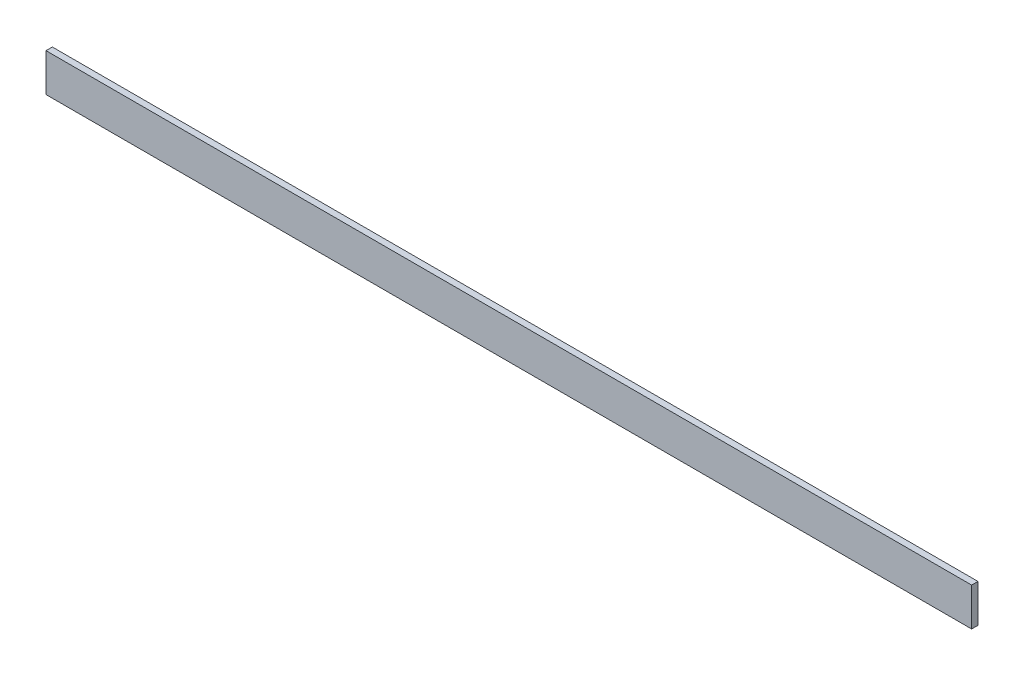
ISO-10303-21;
HEADER;
FILE_DESCRIPTION(('STEP AP214'),'2;1');
FILE_NAME('part.step','',(''),(''),'','','');
FILE_SCHEMA(('AUTOMOTIVE_DESIGN { 1 0 10303 214 1 1 1 1 }'));
ENDSEC;
DATA;
#1=APPLICATION_CONTEXT('core data for automotive mechanical design processes');
#2=APPLICATION_PROTOCOL_DEFINITION('international standard','automotive_design',2000,#1);
#3=PRODUCT_CONTEXT('',#1,'mechanical');
#4=PRODUCT('Part','Part','',(#3));
#5=PRODUCT_RELATED_PRODUCT_CATEGORY('part','',(#4));
#6=PRODUCT_DEFINITION_FORMATION('','',#4);
#7=PRODUCT_DEFINITION_CONTEXT('part definition',#1,'design');
#8=PRODUCT_DEFINITION('design','',#6,#7);
#9=PRODUCT_DEFINITION_SHAPE('','',#8);
#10=(LENGTH_UNIT() NAMED_UNIT(*) SI_UNIT(.MILLI.,.METRE.));
#11=(NAMED_UNIT(*) PLANE_ANGLE_UNIT() SI_UNIT($,.RADIAN.));
#12=(NAMED_UNIT(*) SI_UNIT($,.STERADIAN.) SOLID_ANGLE_UNIT());
#13=UNCERTAINTY_MEASURE_WITH_UNIT(LENGTH_MEASURE(1.E-05),#10,'distance_accuracy_value','');
#14=(GEOMETRIC_REPRESENTATION_CONTEXT(3) GLOBAL_UNCERTAINTY_ASSIGNED_CONTEXT((#13)) GLOBAL_UNIT_ASSIGNED_CONTEXT((#10,
#11,#12)) REPRESENTATION_CONTEXT('',''));
#15=CARTESIAN_POINT('',(0.,0.,0.));
#16=DIRECTION('',(0.,0.,1.));
#17=DIRECTION('',(1.,0.,0.));
#18=AXIS2_PLACEMENT_3D('',#15,#16,#17);
#19=CARTESIAN_POINT('',(730.,0.,0.));
#20=DIRECTION('',(0.,0.,-1.));
#21=DIRECTION('',(-1.,0.,0.));
#22=AXIS2_PLACEMENT_3D('',#19,#20,#21);
#23=PLANE('',#22);
#24=DIRECTION('',(0.,-1.,0.));
#25=VECTOR('',#24,1.);
#26=CARTESIAN_POINT('',(0.,0.,0.));
#27=LINE('',#26,#25);
#28=CARTESIAN_POINT('',(0.,30.,0.));
#29=VERTEX_POINT('',#28);
#30=CARTESIAN_POINT('',(0.,0.,0.));
#31=VERTEX_POINT('',#30);
#32=EDGE_CURVE('E107',#29,#31,#27,.T.);
#33=ORIENTED_EDGE('',*,*,#32,.T.);
#34=DIRECTION('',(-1.,0.,0.));
#35=VECTOR('',#34,1.);
#36=CARTESIAN_POINT('',(730.,0.,0.));
#37=LINE('',#36,#35);
#38=CARTESIAN_POINT('',(730.,0.,0.));
#39=VERTEX_POINT('',#38);
#40=EDGE_CURVE('E11',#39,#31,#37,.T.);
#41=ORIENTED_EDGE('',*,*,#40,.F.);
#42=DIRECTION('',(0.,-1.,0.));
#43=VECTOR('',#42,1.);
#44=CARTESIAN_POINT('',(730.,0.,0.));
#45=LINE('',#44,#43);
#46=CARTESIAN_POINT('',(730.,30.,0.));
#47=VERTEX_POINT('',#46);
#48=EDGE_CURVE('E91',#47,#39,#45,.T.);
#49=ORIENTED_EDGE('',*,*,#48,.F.);
#50=DIRECTION('',(-1.,0.,0.));
#51=VECTOR('',#50,1.);
#52=CARTESIAN_POINT('',(730.,30.,0.));
#53=LINE('',#52,#51);
#54=EDGE_CURVE('E103',#47,#29,#53,.T.);
#55=ORIENTED_EDGE('',*,*,#54,.T.);
#56=EDGE_LOOP('',(#33,#41,#49,#55));
#57=FACE_BOUND('',#56,.T.);
#58=ADVANCED_FACE('F37',(#57),#23,.F.);
#59=CARTESIAN_POINT('',(730.,0.,0.));
#60=DIRECTION('',(0.,1.,0.));
#61=DIRECTION('',(0.,0.,1.));
#62=AXIS2_PLACEMENT_3D('',#59,#60,#61);
#63=PLANE('',#62);
#64=DIRECTION('',(0.,0.,-1.));
#65=VECTOR('',#64,1.);
#66=CARTESIAN_POINT('',(0.,0.,0.));
#67=LINE('',#66,#65);
#68=CARTESIAN_POINT('',(0.,0.,-5.));
#69=VERTEX_POINT('',#68);
#70=EDGE_CURVE('E95',#31,#69,#67,.T.);
#71=ORIENTED_EDGE('',*,*,#70,.T.);
#72=DIRECTION('',(-1.,0.,0.));
#73=VECTOR('',#72,1.);
#74=CARTESIAN_POINT('',(730.,0.,-5.));
#75=LINE('',#74,#73);
#76=CARTESIAN_POINT('',(730.,0.,-5.));
#77=VERTEX_POINT('',#76);
#78=EDGE_CURVE('E46',#77,#69,#75,.T.);
#79=ORIENTED_EDGE('',*,*,#78,.F.);
#80=DIRECTION('',(0.,0.,-1.));
#81=VECTOR('',#80,1.);
#82=CARTESIAN_POINT('',(730.,0.,0.));
#83=LINE('',#82,#81);
#84=EDGE_CURVE('E86',#39,#77,#83,.T.);
#85=ORIENTED_EDGE('',*,*,#84,.F.);
#86=ORIENTED_EDGE('',*,*,#40,.T.);
#87=EDGE_LOOP('',(#71,#79,#85,#86));
#88=FACE_BOUND('',#87,.T.);
#89=ADVANCED_FACE('F94',(#88),#63,.F.);
#90=CARTESIAN_POINT('',(730.,0.,-5.));
#91=DIRECTION('',(0.,0.,1.));
#92=DIRECTION('',(1.,0.,0.));
#93=AXIS2_PLACEMENT_3D('',#90,#91,#92);
#94=PLANE('',#93);
#95=DIRECTION('',(0.,1.,0.));
#96=VECTOR('',#95,1.);
#97=CARTESIAN_POINT('',(0.,0.,-5.));
#98=LINE('',#97,#96);
#99=CARTESIAN_POINT('',(0.,30.,-5.));
#100=VERTEX_POINT('',#99);
#101=EDGE_CURVE('E73',#69,#100,#98,.T.);
#102=ORIENTED_EDGE('',*,*,#101,.T.);
#103=DIRECTION('',(-1.,0.,0.));
#104=VECTOR('',#103,1.);
#105=CARTESIAN_POINT('',(730.,30.,-5.));
#106=LINE('',#105,#104);
#107=CARTESIAN_POINT('',(730.,30.,-5.));
#108=VERTEX_POINT('',#107);
#109=EDGE_CURVE('E97',#108,#100,#106,.T.);
#110=ORIENTED_EDGE('',*,*,#109,.F.);
#111=DIRECTION('',(0.,1.,0.));
#112=VECTOR('',#111,1.);
#113=CARTESIAN_POINT('',(730.,0.,-5.));
#114=LINE('',#113,#112);
#115=EDGE_CURVE('E89',#77,#108,#114,.T.);
#116=ORIENTED_EDGE('',*,*,#115,.F.);
#117=ORIENTED_EDGE('',*,*,#78,.T.);
#118=EDGE_LOOP('',(#102,#110,#116,#117));
#119=FACE_BOUND('',#118,.T.);
#120=ADVANCED_FACE('F98',(#119),#94,.F.);
#121=CARTESIAN_POINT('',(730.,30.,0.));
#122=DIRECTION('',(0.,-1.,0.));
#123=DIRECTION('',(0.,0.,-1.));
#124=AXIS2_PLACEMENT_3D('',#121,#122,#123);
#125=PLANE('',#124);
#126=DIRECTION('',(0.,0.,1.));
#127=VECTOR('',#126,1.);
#128=CARTESIAN_POINT('',(0.,30.,0.));
#129=LINE('',#128,#127);
#130=EDGE_CURVE('E79',#100,#29,#129,.T.);
#131=ORIENTED_EDGE('',*,*,#130,.T.);
#132=ORIENTED_EDGE('',*,*,#54,.F.);
#133=DIRECTION('',(0.,0.,1.));
#134=VECTOR('',#133,1.);
#135=CARTESIAN_POINT('',(730.,30.,0.));
#136=LINE('',#135,#134);
#137=EDGE_CURVE('E56',#108,#47,#136,.T.);
#138=ORIENTED_EDGE('',*,*,#137,.F.);
#139=ORIENTED_EDGE('',*,*,#109,.T.);
#140=EDGE_LOOP('',(#131,#132,#138,#139));
#141=FACE_BOUND('',#140,.T.);
#142=ADVANCED_FACE('F116',(#141),#125,.F.);
#143=CARTESIAN_POINT('',(730.,0.,0.));
#144=DIRECTION('',(-1.,0.,0.));
#145=DIRECTION('',(0.,0.,1.));
#146=AXIS2_PLACEMENT_3D('',#143,#144,#145);
#147=PLANE('',#146);
#148=ORIENTED_EDGE('',*,*,#48,.T.);
#149=ORIENTED_EDGE('',*,*,#84,.T.);
#150=ORIENTED_EDGE('',*,*,#115,.T.);
#151=ORIENTED_EDGE('',*,*,#137,.T.);
#152=EDGE_LOOP('',(#148,#149,#150,#151));
#153=FACE_BOUND('',#152,.T.);
#154=ADVANCED_FACE('F87',(#153),#147,.F.);
#155=CARTESIAN_POINT('',(0.,0.,0.));
#156=DIRECTION('',(-1.,0.,0.));
#157=DIRECTION('',(0.,0.,1.));
#158=AXIS2_PLACEMENT_3D('',#155,#156,#157);
#159=PLANE('',#158);
#160=ORIENTED_EDGE('',*,*,#32,.F.);
#161=ORIENTED_EDGE('',*,*,#130,.F.);
#162=ORIENTED_EDGE('',*,*,#101,.F.);
#163=ORIENTED_EDGE('',*,*,#70,.F.);
#164=EDGE_LOOP('',(#160,#161,#162,#163));
#165=FACE_BOUND('',#164,.T.);
#166=ADVANCED_FACE('F119',(#165),#159,.T.);
#167=CLOSED_SHELL('',(#58,#89,#120,#142,#154,#166));
#168=MANIFOLD_SOLID_BREP('B2',#167);
#169=ADVANCED_BREP_SHAPE_REPRESENTATION('',(#18,#168),#14);
#170=SHAPE_DEFINITION_REPRESENTATION(#9,#169);
ENDSEC;
END-ISO-10303-21;
